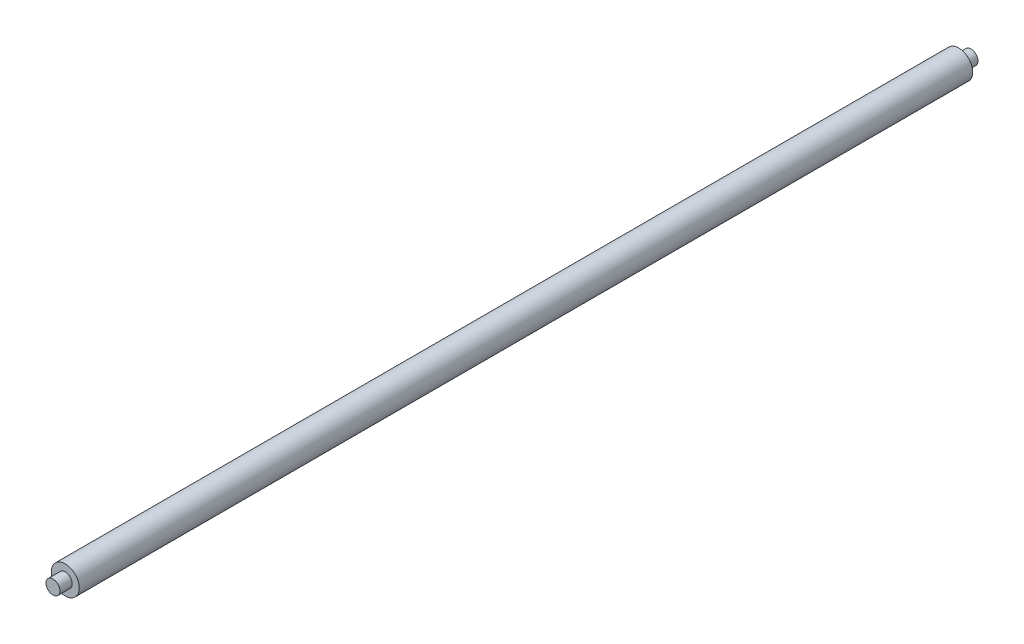
ISO-10303-21;
HEADER;
FILE_DESCRIPTION(('STEP AP214'),'2;1');
FILE_NAME('part.step','',(''),(''),'','','');
FILE_SCHEMA(('AUTOMOTIVE_DESIGN { 1 0 10303 214 1 1 1 1 }'));
ENDSEC;
DATA;
#1=APPLICATION_CONTEXT('core data for automotive mechanical design processes');
#2=APPLICATION_PROTOCOL_DEFINITION('international standard','automotive_design',2000,#1);
#3=PRODUCT_CONTEXT('',#1,'mechanical');
#4=PRODUCT('Part','Part','',(#3));
#5=PRODUCT_RELATED_PRODUCT_CATEGORY('part','',(#4));
#6=PRODUCT_DEFINITION_FORMATION('','',#4);
#7=PRODUCT_DEFINITION_CONTEXT('part definition',#1,'design');
#8=PRODUCT_DEFINITION('design','',#6,#7);
#9=PRODUCT_DEFINITION_SHAPE('','',#8);
#10=(LENGTH_UNIT() NAMED_UNIT(*) SI_UNIT(.MILLI.,.METRE.));
#11=(NAMED_UNIT(*) PLANE_ANGLE_UNIT() SI_UNIT($,.RADIAN.));
#12=(NAMED_UNIT(*) SI_UNIT($,.STERADIAN.) SOLID_ANGLE_UNIT());
#13=UNCERTAINTY_MEASURE_WITH_UNIT(LENGTH_MEASURE(1.E-05),#10,'distance_accuracy_value','');
#14=(GEOMETRIC_REPRESENTATION_CONTEXT(3) GLOBAL_UNCERTAINTY_ASSIGNED_CONTEXT((#13)) GLOBAL_UNIT_ASSIGNED_CONTEXT((#10,
#11,#12)) REPRESENTATION_CONTEXT('',''));
#15=CARTESIAN_POINT('',(0.,0.,0.));
#16=DIRECTION('',(0.,0.,1.));
#17=DIRECTION('',(1.,0.,0.));
#18=AXIS2_PLACEMENT_3D('',#15,#16,#17);
#19=CARTESIAN_POINT('',(0.,0.,11.));
#20=DIRECTION('',(0.,0.,-1.));
#21=DIRECTION('',(-1.,0.,0.));
#22=AXIS2_PLACEMENT_3D('',#19,#20,#21);
#23=CYLINDRICAL_SURFACE('',#22,6.25);
#24=CARTESIAN_POINT('',(0.,0.,11.));
#25=DIRECTION('',(0.,0.,1.));
#26=DIRECTION('',(1.,0.,0.));
#27=AXIS2_PLACEMENT_3D('',#24,#25,#26);
#28=CIRCLE('',#27,6.25);
#29=CARTESIAN_POINT('',(6.25,0.,11.));
#30=VERTEX_POINT('',#29);
#31=EDGE_CURVE('E42',#30,#30,#28,.T.);
#32=ORIENTED_EDGE('',*,*,#31,.F.);
#33=EDGE_LOOP('',(#32));
#34=FACE_BOUND('',#33,.T.);
#35=CARTESIAN_POINT('',(0.,0.,0.));
#36=DIRECTION('',(0.,0.,1.));
#37=DIRECTION('',(1.,0.,0.));
#38=AXIS2_PLACEMENT_3D('',#35,#36,#37);
#39=CIRCLE('',#38,6.25);
#40=CARTESIAN_POINT('',(6.25,0.,0.));
#41=VERTEX_POINT('',#40);
#42=EDGE_CURVE('E38',#41,#41,#39,.T.);
#43=ORIENTED_EDGE('',*,*,#42,.T.);
#44=EDGE_LOOP('',(#43));
#45=FACE_BOUND('',#44,.T.);
#46=ADVANCED_FACE('F35',(#34,#45),#23,.T.);
#47=CARTESIAN_POINT('',(0.,0.,0.));
#48=DIRECTION('',(0.,0.,1.));
#49=DIRECTION('',(1.,0.,0.));
#50=AXIS2_PLACEMENT_3D('',#47,#48,#49);
#51=PLANE('',#50);
#52=ORIENTED_EDGE('',*,*,#42,.F.);
#53=EDGE_LOOP('',(#52));
#54=FACE_BOUND('',#53,.T.);
#55=ADVANCED_FACE('F76',(#54),#51,.F.);
#56=CARTESIAN_POINT('',(0.,0.,811.));
#57=DIRECTION('',(0.,0.,-1.));
#58=DIRECTION('',(-1.,0.,0.));
#59=AXIS2_PLACEMENT_3D('',#56,#57,#58);
#60=CYLINDRICAL_SURFACE('',#59,12.5);
#61=CARTESIAN_POINT('',(0.,0.,811.));
#62=DIRECTION('',(0.,0.,1.));
#63=DIRECTION('',(1.,0.,0.));
#64=AXIS2_PLACEMENT_3D('',#61,#62,#63);
#65=CIRCLE('',#64,12.5);
#66=CARTESIAN_POINT('',(12.5,0.,811.));
#67=VERTEX_POINT('',#66);
#68=EDGE_CURVE('E50',#67,#67,#65,.T.);
#69=ORIENTED_EDGE('',*,*,#68,.F.);
#70=EDGE_LOOP('',(#69));
#71=FACE_BOUND('',#70,.T.);
#72=CARTESIAN_POINT('',(0.,0.,11.));
#73=DIRECTION('',(0.,0.,1.));
#74=DIRECTION('',(1.,0.,0.));
#75=AXIS2_PLACEMENT_3D('',#72,#73,#74);
#76=CIRCLE('',#75,12.5);
#77=CARTESIAN_POINT('',(12.5,0.,11.));
#78=VERTEX_POINT('',#77);
#79=EDGE_CURVE('E53',#78,#78,#76,.T.);
#80=ORIENTED_EDGE('',*,*,#79,.T.);
#81=EDGE_LOOP('',(#80));
#82=FACE_BOUND('',#81,.T.);
#83=ADVANCED_FACE('F81',(#71,#82),#60,.T.);
#84=CARTESIAN_POINT('',(0.,0.,811.));
#85=DIRECTION('',(0.,0.,1.));
#86=DIRECTION('',(1.,0.,0.));
#87=AXIS2_PLACEMENT_3D('',#84,#85,#86);
#88=PLANE('',#87);
#89=CARTESIAN_POINT('',(0.,0.,811.));
#90=DIRECTION('',(0.,0.,1.));
#91=DIRECTION('',(1.,0.,0.));
#92=AXIS2_PLACEMENT_3D('',#89,#90,#91);
#93=CIRCLE('',#92,6.25);
#94=CARTESIAN_POINT('',(6.25,0.,811.));
#95=VERTEX_POINT('',#94);
#96=EDGE_CURVE('E10',#95,#95,#93,.T.);
#97=ORIENTED_EDGE('',*,*,#96,.F.);
#98=EDGE_LOOP('',(#97));
#99=FACE_BOUND('',#98,.T.);
#100=ORIENTED_EDGE('',*,*,#68,.T.);
#101=EDGE_LOOP('',(#100));
#102=FACE_BOUND('',#101,.T.);
#103=ADVANCED_FACE('F71',(#99,#102),#88,.T.);
#104=CARTESIAN_POINT('',(0.,0.,11.));
#105=DIRECTION('',(0.,0.,1.));
#106=DIRECTION('',(1.,0.,0.));
#107=AXIS2_PLACEMENT_3D('',#104,#105,#106);
#108=PLANE('',#107);
#109=ORIENTED_EDGE('',*,*,#31,.T.);
#110=EDGE_LOOP('',(#109));
#111=FACE_BOUND('',#110,.T.);
#112=ORIENTED_EDGE('',*,*,#79,.F.);
#113=EDGE_LOOP('',(#112));
#114=FACE_BOUND('',#113,.T.);
#115=ADVANCED_FACE('F64',(#111,#114),#108,.F.);
#116=CARTESIAN_POINT('',(0.,0.,822.));
#117=DIRECTION('',(0.,0.,-1.));
#118=DIRECTION('',(-1.,0.,0.));
#119=AXIS2_PLACEMENT_3D('',#116,#117,#118);
#120=CYLINDRICAL_SURFACE('',#119,6.25);
#121=CARTESIAN_POINT('',(0.,0.,822.));
#122=DIRECTION('',(0.,0.,1.));
#123=DIRECTION('',(1.,0.,0.));
#124=AXIS2_PLACEMENT_3D('',#121,#122,#123);
#125=CIRCLE('',#124,6.25);
#126=CARTESIAN_POINT('',(6.25,0.,822.));
#127=VERTEX_POINT('',#126);
#128=EDGE_CURVE('E49',#127,#127,#125,.T.);
#129=ORIENTED_EDGE('',*,*,#128,.F.);
#130=EDGE_LOOP('',(#129));
#131=FACE_BOUND('',#130,.T.);
#132=ORIENTED_EDGE('',*,*,#96,.T.);
#133=EDGE_LOOP('',(#132));
#134=FACE_BOUND('',#133,.T.);
#135=ADVANCED_FACE('F62',(#131,#134),#120,.T.);
#136=CARTESIAN_POINT('',(0.,0.,822.));
#137=DIRECTION('',(0.,0.,1.));
#138=DIRECTION('',(1.,0.,0.));
#139=AXIS2_PLACEMENT_3D('',#136,#137,#138);
#140=PLANE('',#139);
#141=ORIENTED_EDGE('',*,*,#128,.T.);
#142=EDGE_LOOP('',(#141));
#143=FACE_BOUND('',#142,.T.);
#144=ADVANCED_FACE('F60',(#143),#140,.T.);
#145=CLOSED_SHELL('',(#46,#55,#83,#103,#115,#135,#144));
#146=MANIFOLD_SOLID_BREP('B2',#145);
#147=ADVANCED_BREP_SHAPE_REPRESENTATION('',(#18,#146),#14);
#148=SHAPE_DEFINITION_REPRESENTATION(#9,#147);
ENDSEC;
END-ISO-10303-21;
